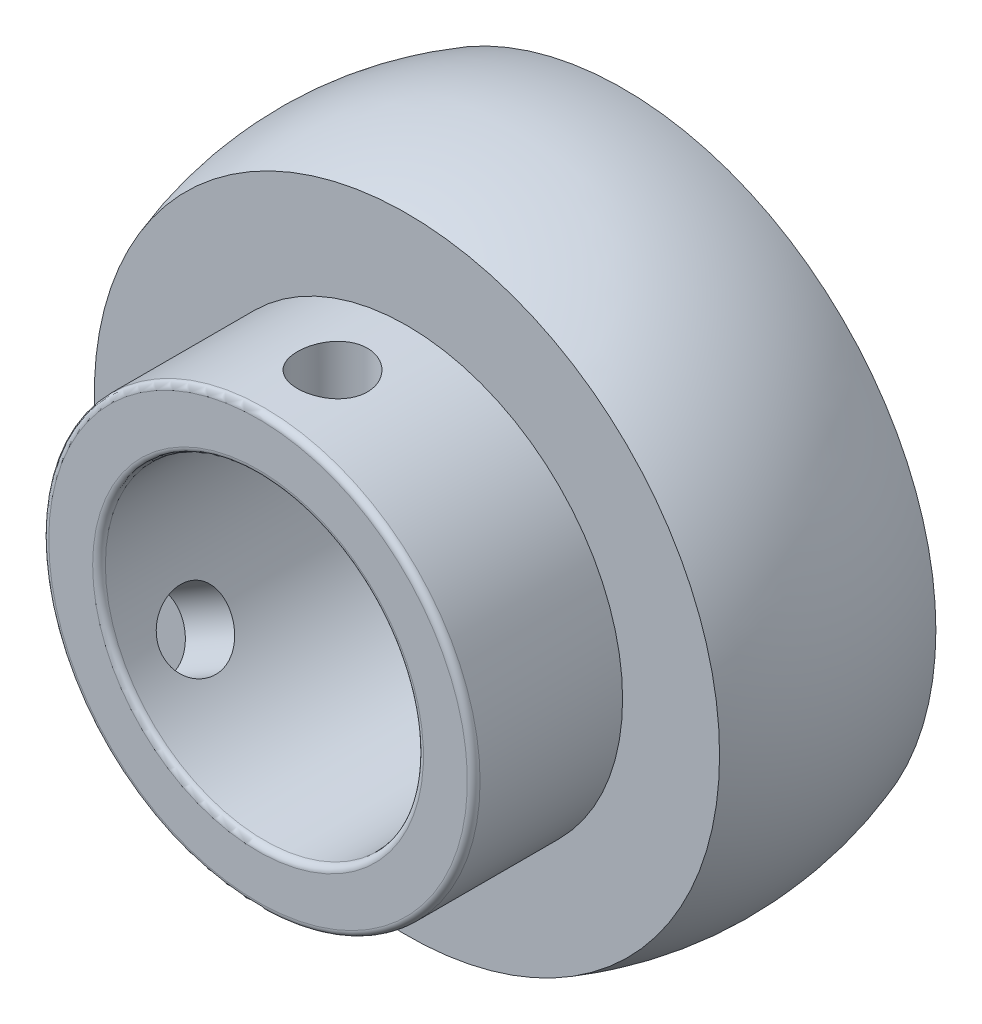
ISO-10303-21;
HEADER;
FILE_DESCRIPTION(('STEP AP214'),'2;1');
FILE_NAME('part.step','',(''),(''),'','','');
FILE_SCHEMA(('AUTOMOTIVE_DESIGN { 1 0 10303 214 1 1 1 1 }'));
ENDSEC;
DATA;
#1=APPLICATION_CONTEXT('core data for automotive mechanical design processes');
#2=APPLICATION_PROTOCOL_DEFINITION('international standard','automotive_design',2000,#1);
#3=PRODUCT_CONTEXT('',#1,'mechanical');
#4=PRODUCT('Part','Part','',(#3));
#5=PRODUCT_RELATED_PRODUCT_CATEGORY('part','',(#4));
#6=PRODUCT_DEFINITION_FORMATION('','',#4);
#7=PRODUCT_DEFINITION_CONTEXT('part definition',#1,'design');
#8=PRODUCT_DEFINITION('design','',#6,#7);
#9=PRODUCT_DEFINITION_SHAPE('','',#8);
#10=(LENGTH_UNIT() NAMED_UNIT(*) SI_UNIT(.MILLI.,.METRE.));
#11=(NAMED_UNIT(*) PLANE_ANGLE_UNIT() SI_UNIT($,.RADIAN.));
#12=(NAMED_UNIT(*) SI_UNIT($,.STERADIAN.) SOLID_ANGLE_UNIT());
#13=UNCERTAINTY_MEASURE_WITH_UNIT(LENGTH_MEASURE(1.E-05),#10,'distance_accuracy_value','');
#14=(GEOMETRIC_REPRESENTATION_CONTEXT(3) GLOBAL_UNCERTAINTY_ASSIGNED_CONTEXT((#13)) GLOBAL_UNIT_ASSIGNED_CONTEXT((#10,
#11,#12)) REPRESENTATION_CONTEXT('',''));
#15=CARTESIAN_POINT('',(0.,0.,0.));
#16=DIRECTION('',(0.,0.,1.));
#17=DIRECTION('',(1.,0.,0.));
#18=AXIS2_PLACEMENT_3D('',#15,#16,#17);
#19=CARTESIAN_POINT('',(0.,0.,1108.80906234376));
#20=DIRECTION('',(0.,0.,1.));
#21=DIRECTION('',(1.,0.,0.));
#22=AXIS2_PLACEMENT_3D('',#19,#20,#21);
#23=CYLINDRICAL_SURFACE('',#22,16.95);
#24=CARTESIAN_POINT('',(0.,0.,11.2000000000001));
#25=DIRECTION('',(0.,0.,-1.));
#26=DIRECTION('',(-1.,0.,0.));
#27=AXIS2_PLACEMENT_3D('',#24,#25,#26);
#28=CIRCLE('',#27,16.95);
#29=CARTESIAN_POINT('',(-16.95,0.,11.2000000000001));
#30=VERTEX_POINT('',#29);
#31=EDGE_CURVE('E10',#30,#30,#28,.T.);
#32=ORIENTED_EDGE('',*,*,#31,.T.);
#33=EDGE_LOOP('',(#32));
#34=FACE_BOUND('',#33,.T.);
#35=CARTESIAN_POINT('',(-15.8596470443708,-5.98114500977696,5.85000000000002));
#36=CARTESIAN_POINT('',(-15.8596462910381,-5.98115174981211,6.00337408236018));
#37=CARTESIAN_POINT('',(-15.8550566307016,-5.99336091997057,6.15683337646068));
#38=CARTESIAN_POINT('',(-15.8366724370185,-6.0417671910909,6.45945036918039));
#39=CARTESIAN_POINT('',(-15.8228692800347,-6.07798676506253,6.6086039011244));
#40=CARTESIAN_POINT('',(-15.7860310091049,-6.17303043917451,6.89818582192308));
#41=CARTESIAN_POINT('',(-15.7630034361827,-6.23183607344074,7.03862122985632));
#42=CARTESIAN_POINT('',(-15.7077009184341,-6.36994028680056,7.30700553622687));
#43=CARTESIAN_POINT('',(-15.6754270779685,-6.44923641842801,7.43495592341176));
#44=CARTESIAN_POINT('',(-15.6013771628814,-6.6263712800195,7.67595054758589));
#45=CARTESIAN_POINT('',(-15.5595238716469,-6.72435954856196,7.78886116296499));
#46=CARTESIAN_POINT('',(-15.4666933373265,-6.93521019990093,7.99541124853216));
#47=CARTESIAN_POINT('',(-15.4157155647878,-7.04807344572565,8.08904959975863));
#48=CARTESIAN_POINT('',(-15.3048270775974,-7.28574181751346,8.25489634410702));
#49=CARTESIAN_POINT('',(-15.2448675413527,-7.41061078389685,8.3269807285113));
#50=CARTESIAN_POINT('',(-15.1171449994173,-7.66779080520888,8.44687660014083));
#51=CARTESIAN_POINT('',(-15.0493824751406,-7.8001014007607,8.49468958383335));
#52=CARTESIAN_POINT('',(-14.9080735493801,-8.06687154563015,8.56427770143223));
#53=CARTESIAN_POINT('',(-14.8345829861523,-8.20130213513919,8.58627715502793));
#54=CARTESIAN_POINT('',(-14.6831687498486,-8.46940068306775,8.60431098993956));
#55=CARTESIAN_POINT('',(-14.6052453633176,-8.60306869016861,8.60034704768439));
#56=CARTESIAN_POINT('',(-14.4480145560672,-8.86456108327893,8.56674212530542));
#57=CARTESIAN_POINT('',(-14.3687269946498,-8.99242854638151,8.53734253471723));
#58=CARTESIAN_POINT('',(-14.2106294533691,-9.24024501019523,8.45408063461123));
#59=CARTESIAN_POINT('',(-14.1318194875157,-9.36019377962793,8.40021761096045));
#60=CARTESIAN_POINT('',(-13.9770982305871,-9.58970715050389,8.26931593899699));
#61=CARTESIAN_POINT('',(-13.901201081544,-9.69922417874228,8.19217723301118));
#62=CARTESIAN_POINT('',(-13.7555097448136,-9.9047638410086,8.01698711549566));
#63=CARTESIAN_POINT('',(-13.6857160263477,-10.0007854378746,7.91893409809854));
#64=CARTESIAN_POINT('',(-13.5542466384141,-10.178273910667,7.70335824516074));
#65=CARTESIAN_POINT('',(-13.4926735469916,-10.2595607252343,7.58562449146299));
#66=CARTESIAN_POINT('',(-13.3812504446696,-10.4044710524195,7.33474148521148));
#67=CARTESIAN_POINT('',(-13.3314005312238,-10.4680944182038,7.20159210452284));
#68=CARTESIAN_POINT('',(-13.245654528233,-10.5763857231716,6.92342384624294));
#69=CARTESIAN_POINT('',(-13.2097727232128,-10.6210342619512,6.77839300049092));
#70=CARTESIAN_POINT('',(-13.1537746043906,-10.6903094861815,6.48070778065528));
#71=CARTESIAN_POINT('',(-13.1336569794752,-10.7149378367257,6.32805404169438));
#72=CARTESIAN_POINT('',(-13.1103289348569,-10.7434685174464,6.02130757597654));
#73=CARTESIAN_POINT('',(-13.1069296448467,-10.7476023821559,5.86725071743524));
#74=CARTESIAN_POINT('',(-13.1166964976695,-10.7356802347487,5.5604539233994));
#75=CARTESIAN_POINT('',(-13.1298620355698,-10.7196249599212,5.40771394001886));
#76=CARTESIAN_POINT('',(-13.1719747876214,-10.6678335135248,5.1088171618045));
#77=CARTESIAN_POINT('',(-13.2008275298305,-10.6322151424471,4.96262657302503));
#78=CARTESIAN_POINT('',(-13.2728770360505,-10.5421317562364,4.67990771770392));
#79=CARTESIAN_POINT('',(-13.3160746174851,-10.487665667081,4.54338000232771));
#80=CARTESIAN_POINT('',(-13.4152910276631,-10.3604539319261,4.28254710438371));
#81=CARTESIAN_POINT('',(-13.4714188468294,-10.2875523492786,4.15835945732246));
#82=CARTESIAN_POINT('',(-13.5938425721377,-10.1252285570984,3.92694516672308));
#83=CARTESIAN_POINT('',(-13.6601391545629,-10.0358052486918,3.81971965223172));
#84=CARTESIAN_POINT('',(-13.8008740522057,-9.84138656719045,3.62420122187582));
#85=CARTESIAN_POINT('',(-13.875385960358,-9.73624683052579,3.53610466952486));
#86=CARTESIAN_POINT('',(-14.0290647798705,-9.51347080104401,3.38271829712443));
#87=CARTESIAN_POINT('',(-14.1082315467482,-9.39583489600505,3.31742776963323));
#88=CARTESIAN_POINT('',(-14.2679340600251,-9.1514890616661,3.21181463499007));
#89=CARTESIAN_POINT('',(-14.3484626346489,-9.02481944476585,3.17138800759656));
#90=CARTESIAN_POINT('',(-14.5084296374703,-8.76533986872388,3.11631480246032));
#91=CARTESIAN_POINT('',(-14.5878681499944,-8.63253038807117,3.10166621925908));
#92=CARTESIAN_POINT('',(-14.7422731200954,-8.36608179390217,3.09862022189213));
#93=CARTESIAN_POINT('',(-14.8172804267719,-8.23246967704893,3.10992357891809));
#94=CARTESIAN_POINT('',(-14.961792130735,-7.96681541877084,3.15781498955059));
#95=CARTESIAN_POINT('',(-15.0312965549764,-7.83477326965851,3.19440291929717));
#96=CARTESIAN_POINT('',(-15.163198444751,-7.57634192991746,3.29171239637208));
#97=CARTESIAN_POINT('',(-15.2256029423898,-7.44994722250901,3.35240979207613));
#98=CARTESIAN_POINT('',(-15.3423292272478,-7.20650265059764,3.49618232202034));
#99=CARTESIAN_POINT('',(-15.3966506638358,-7.08945319157965,3.57925842657642));
#100=CARTESIAN_POINT('',(-15.4971087492387,-6.86710912075234,3.76649684104858));
#101=CARTESIAN_POINT('',(-15.5431498893181,-6.76195630005735,3.87087879237434));
#102=CARTESIAN_POINT('',(-15.6259813633791,-6.56828214368505,4.09730439294206));
#103=CARTESIAN_POINT('',(-15.6627695277473,-6.47976470985691,4.21935217387131));
#104=CARTESIAN_POINT('',(-15.7271739527252,-6.32185428604761,4.47860841803772));
#105=CARTESIAN_POINT('',(-15.7547274618221,-6.25259266438729,4.61591248676573));
#106=CARTESIAN_POINT('',(-15.8002968495197,-6.13653323849323,4.90107777519187));
#107=CARTESIAN_POINT('',(-15.8183223600545,-6.08971275280831,5.0489281612112));
#108=CARTESIAN_POINT('',(-15.8409637349658,-6.03050790736157,5.3061494714925));
#109=CARTESIAN_POINT('',(-15.8479696608116,-6.01203236070585,5.41395393949813));
#110=CARTESIAN_POINT('',(-15.8573115454801,-5.98734860912903,5.6311578266936));
#111=CARTESIAN_POINT('',(-15.8596475819247,-5.98114020030604,5.74055721934247));
#112=CARTESIAN_POINT('',(-15.8596470443708,-5.98114500977696,5.85000000000002));
#113=B_SPLINE_CURVE_WITH_KNOTS('',3,(#35,#36,#37,#38,#39,#40,#41,#42,#43,#44,#45,#46,#47,#48,
#49,#50,#51,#52,#53,#54,#55,#56,#57,#58,#59,#60,#61,#62,#63,#64,#65,#66,#67,#68,#69,#70,#71,#72,
#73,#74,#75,#76,#77,#78,#79,#80,#81,#82,#83,#84,#85,#86,#87,#88,#89,#90,#91,#92,#93,#94,#95,#96,
#97,#98,#99,#100,#101,#102,#103,#104,#105,#106,#107,#108,#109,#110,#111,#112),.UNSPECIFIED.,.T.,
.F.,(4,2,2,2,2,2,2,2,2,2,2,2,2,2,2,2,2,2,2,2,2,2,2,2,2,2,2,2,2,2,2,2,2,2,2,2,2,2,4),(0.,
0.459722087063456,0.919875068730116,1.37965263736226,1.83937531370516,2.30294299209723,
2.76653757797589,3.23275024219922,3.69893415831795,4.16103620542986,4.62310841539724,
5.08084297597257,5.53859089952747,5.99833532704694,6.45811506792315,6.92318181536329,
7.38825242872168,7.8537974061869,8.31930365997489,8.77953872301793,9.23975697917785,
9.69723390846359,10.1547369110082,10.6162473052031,11.0777884059003,11.5438641519955,
12.0099254391606,12.4740234151387,12.9380852840178,13.396823376938,13.8555592226822,
14.3138366847086,14.7721340203356,15.2354189997983,15.6988125080372,16.16529388953,
16.6313027947961,16.959351048331,17.2873938490681),.UNSPECIFIED.);
#114=CARTESIAN_POINT('',(-15.8596470443708,-5.98114500977696,5.85000000000002));
#115=VERTEX_POINT('',#114);
#116=EDGE_CURVE('E75',#115,#115,#113,.T.);
#117=ORIENTED_EDGE('',*,*,#116,.T.);
#118=EDGE_LOOP('',(#117));
#119=FACE_BOUND('',#118,.T.);
#120=CARTESIAN_POINT('',(0.,0.,0.));
#121=DIRECTION('',(0.,0.,1.));
#122=DIRECTION('',(1.,0.,0.));
#123=AXIS2_PLACEMENT_3D('',#120,#121,#122);
#124=CIRCLE('',#123,16.95);
#125=CARTESIAN_POINT('',(16.95,0.,0.));
#126=VERTEX_POINT('',#125);
#127=EDGE_CURVE('E66',#126,#126,#124,.T.);
#128=ORIENTED_EDGE('',*,*,#127,.T.);
#129=EDGE_LOOP('',(#128));
#130=FACE_BOUND('',#129,.T.);
#131=CARTESIAN_POINT('',(0.,16.95,3.10000000000002));
#132=CARTESIAN_POINT('',(-0.153389059454766,16.9499974130401,3.10000620112862));
#133=CARTESIAN_POINT('',(-0.306863292480428,16.947896133266,3.11287691126683));
#134=CARTESIAN_POINT('',(-0.609511314947893,16.9397160235475,3.16400058951898));
#135=CARTESIAN_POINT('',(-0.758680949663987,16.9336334767425,3.20227727680194));
#136=CARTESIAN_POINT('',(-1.0482969489586,16.9181734303794,3.30303015296313));
#137=CARTESIAN_POINT('',(-1.18875019627735,16.9087985705178,3.36548695890764));
#138=CARTESIAN_POINT('',(-1.45716449699236,16.8877861005744,3.51277731265846));
#139=CARTESIAN_POINT('',(-1.58512706041742,16.876148764519,3.59760815101248));
#140=CARTESIAN_POINT('',(-1.82610836260845,16.8517843803313,3.78805824938138));
#141=CARTESIAN_POINT('',(-1.93899723649143,16.8390492465989,3.89384081376929));
#142=CARTESIAN_POINT('',(-2.14550523830881,16.8139868653862,4.12284009422015));
#143=CARTESIAN_POINT('',(-2.23912318048418,16.8016596430442,4.24605788230258));
#144=CARTESIAN_POINT('',(-2.4049482400678,16.7787304854001,4.50731669008348));
#145=CARTESIAN_POINT('',(-2.47702769368394,16.7681389989981,4.64543973692465));
#146=CARTESIAN_POINT('',(-2.59691346709427,16.7499922306476,4.93203320848444));
#147=CARTESIAN_POINT('',(-2.64472133851663,16.7424367546201,5.08050297107031));
#148=CARTESIAN_POINT('',(-2.7142992775722,16.7312976935851,5.38220163852072));
#149=CARTESIAN_POINT('',(-2.73629304816392,16.7276800042314,5.53537767011275));
#150=CARTESIAN_POINT('',(-2.7543118961929,16.7247228602696,5.84328551995204));
#151=CARTESIAN_POINT('',(-2.75033871547278,16.7253831187,5.99801723315021));
#152=CARTESIAN_POINT('',(-2.71671882279076,16.7308761179047,6.30305187356132));
#153=CARTESIAN_POINT('',(-2.68732281488257,16.7356681126786,6.45338327277067));
#154=CARTESIAN_POINT('',(-2.60408488113202,16.7488209028777,6.74695155476423));
#155=CARTESIAN_POINT('',(-2.55024215705012,16.7571818148354,6.89018820571977));
#156=CARTESIAN_POINT('',(-2.41938320674402,16.7765746647278,7.16625492776145));
#157=CARTESIAN_POINT('',(-2.34226230193971,16.7876186232151,7.29903450085429));
#158=CARTESIAN_POINT('',(-2.16711055242278,16.8111247531707,7.54986315720259));
#159=CARTESIAN_POINT('',(-2.06907810663207,16.8235870331977,7.667911111444));
#160=CARTESIAN_POINT('',(-1.85351728857188,16.8487049339815,7.88737727369986));
#161=CARTESIAN_POINT('',(-1.73577369132912,16.8613611077523,7.98858414253347));
#162=CARTESIAN_POINT('',(-1.48486233044964,16.8853054479757,8.16983526519684));
#163=CARTESIAN_POINT('',(-1.35169447685486,16.896593606449,8.24987939559137));
#164=CARTESIAN_POINT('',(-1.07352031607205,16.9165448634316,8.38654980154586));
#165=CARTESIAN_POINT('',(-0.928505002404181,16.9252059408055,8.44315805895717));
#166=CARTESIAN_POINT('',(-0.63085367379564,16.9389107688613,8.53115711172265));
#167=CARTESIAN_POINT('',(-0.478218263593114,16.9439548061083,8.5625499048318));
#168=CARTESIAN_POINT('',(-0.171481721980738,16.9498188541912,8.59894191478247));
#169=CARTESIAN_POINT('',(-0.0174158819668336,16.9506853126854,8.60423137250858));
#170=CARTESIAN_POINT('',(0.289401189382925,16.9482235782016,8.58903941934736));
#171=CARTESIAN_POINT('',(0.442152468359942,16.9448955378869,8.56855894638488));
#172=CARTESIAN_POINT('',(0.741112647800682,16.9344474931192,8.50264989312986));
#173=CARTESIAN_POINT('',(0.887353913818307,16.9273492404217,8.45736437597433));
#174=CARTESIAN_POINT('',(1.17016852324185,16.9101536436188,8.3432827811373));
#175=CARTESIAN_POINT('',(1.30674134711993,16.9000561385016,8.27448544121816));
#176=CARTESIAN_POINT('',(1.56760726939961,16.8778674448984,8.11466391420762));
#177=CARTESIAN_POINT('',(1.69178742620458,16.8657602025153,8.02345765140552));
#178=CARTESIAN_POINT('',(1.92318302950037,16.8409451929571,7.82165858397314));
#179=CARTESIAN_POINT('',(2.03039731119286,16.8282373846277,7.71106444935923));
#180=CARTESIAN_POINT('',(2.22588818054235,16.8035040993372,7.47232987492587));
#181=CARTESIAN_POINT('',(2.31396908382058,16.7914865207447,7.34402825036072));
#182=CARTESIAN_POINT('',(2.46732803492165,16.7696397697313,7.07427965391665));
#183=CARTESIAN_POINT('',(2.53260677754169,16.7598105306334,6.93283308273942));
#184=CARTESIAN_POINT('',(2.63821277839327,16.7435120658835,6.641366885527));
#185=CARTESIAN_POINT('',(2.67863897017396,16.7370295343326,6.49138388322083));
#186=CARTESIAN_POINT('',(2.73370467180344,16.7281245271578,6.1866428556018));
#187=CARTESIAN_POINT('',(2.74834629502106,16.7257017187895,6.03188522268786));
#188=CARTESIAN_POINT('',(2.75137067254371,16.7252042980443,5.72394094521704));
#189=CARTESIAN_POINT('',(2.74006134344572,16.727078697641,5.57075731953614));
#190=CARTESIAN_POINT('',(2.69216902032867,16.7348530057471,5.26850272269664));
#191=CARTESIAN_POINT('',(2.65558609612248,16.740752903137,5.11943174017893));
#192=CARTESIAN_POINT('',(2.55830053485422,16.7558944849549,4.82974382002459));
#193=CARTESIAN_POINT('',(2.49762304197272,16.7651326847553,4.68911824464745));
#194=CARTESIAN_POINT('',(2.3539020817855,16.7859135582853,4.41999310976271));
#195=CARTESIAN_POINT('',(2.27085760097402,16.7974563364353,4.29149410009738));
#196=CARTESIAN_POINT('',(2.08365557459899,16.8217080725818,4.04871156930423));
#197=CARTESIAN_POINT('',(1.97927106152911,16.834428687139,3.93460419632951));
#198=CARTESIAN_POINT('',(1.75283116153535,16.8595086456252,3.72541894768741));
#199=CARTESIAN_POINT('',(1.63077169536769,16.8718679053628,3.63034547700014));
#200=CARTESIAN_POINT('',(1.3715044049896,16.8949255274868,3.46136424326375));
#201=CARTESIAN_POINT('',(1.2342031227464,16.9056125516139,3.38759832316801));
#202=CARTESIAN_POINT('',(0.949043374706975,16.9240110777408,3.26428967272681));
#203=CARTESIAN_POINT('',(0.801195712296509,16.9317255742712,3.21472255094327));
#204=CARTESIAN_POINT('',(0.543956994970018,16.9416049080306,3.15211170202708));
#205=CARTESIAN_POINT('',(0.436131215104201,16.9447364230155,3.1326007125166));
#206=CARTESIAN_POINT('',(0.218884732317048,16.9489348757536,3.10654275131267));
#207=CARTESIAN_POINT('',(0.109464054640321,16.9500018461494,3.09999557464738));
#208=CARTESIAN_POINT('',(0.,16.95,3.10000000000002));
#209=B_SPLINE_CURVE_WITH_KNOTS('',3,(#131,#132,#133,#134,#135,#136,#137,#138,#139,#140,#141,
#142,#143,#144,#145,#146,#147,#148,#149,#150,#151,#152,#153,#154,#155,#156,#157,#158,#159,#160,
#161,#162,#163,#164,#165,#166,#167,#168,#169,#170,#171,#172,#173,#174,#175,#176,#177,#178,#179,
#180,#181,#182,#183,#184,#185,#186,#187,#188,#189,#190,#191,#192,#193,#194,#195,#196,#197,#198,
#199,#200,#201,#202,#203,#204,#205,#206,#207,#208),.UNSPECIFIED.,.T.,.F.,(4,2,2,2,2,2,2,2,2,2,2,
2,2,2,2,2,2,2,2,2,2,2,2,2,2,2,2,2,2,2,2,2,2,2,2,2,2,2,4),(0.,0.459767091588934,
0.919964029322791,1.37979283159832,1.83956597503691,2.3030747422894,2.76661202116426,
3.2328446503992,3.69904747066662,4.16117966499257,4.62328086017345,5.08087639959464,
5.53848688160015,5.99818662950461,6.45792158665255,6.92304993862742,7.38818100348203,
7.85366901285281,8.31912013919287,8.77938410605079,9.23963132158241,9.69725159111427,
10.1548964319564,10.6163903663298,11.0779159710033,11.5439600977784,12.0099900226359,
12.4741525451739,12.9382770219998,13.3969230274058,13.8555677659056,14.3137351326608,
14.7719232636514,15.2352649598518,15.6987137627061,16.1651801338753,16.6311753494978,
16.9592871846755,17.2873938320101),.UNSPECIFIED.);
#210=CARTESIAN_POINT('',(0.,16.95,3.10000000000002));
#211=VERTEX_POINT('',#210);
#212=EDGE_CURVE('E100',#211,#211,#209,.T.);
#213=ORIENTED_EDGE('',*,*,#212,.F.);
#214=EDGE_LOOP('',(#213));
#215=FACE_BOUND('',#214,.T.);
#216=ADVANCED_FACE('F34',(#34,#119,#130,#215),#23,.T.);
#217=CARTESIAN_POINT('',(0.,0.,1108.80906234376));
#218=DIRECTION('',(0.,0.,1.));
#219=DIRECTION('',(1.,0.,0.));
#220=AXIS2_PLACEMENT_3D('',#217,#218,#219);
#221=CYLINDRICAL_SURFACE('',#220,12.5);
#222=CARTESIAN_POINT('',(0.,0.,-22.));
#223=DIRECTION('',(0.,0.,1.));
#224=DIRECTION('',(1.,0.,0.));
#225=AXIS2_PLACEMENT_3D('',#222,#223,#224);
#226=CIRCLE('',#225,12.5);
#227=CARTESIAN_POINT('',(12.5,0.,-22.));
#228=VERTEX_POINT('',#227);
#229=EDGE_CURVE('E54',#228,#228,#226,.F.);
#230=ORIENTED_EDGE('',*,*,#229,.T.);
#231=EDGE_LOOP('',(#230));
#232=FACE_BOUND('',#231,.T.);
#233=CARTESIAN_POINT('',(0.,0.,11.2000000000001));
#234=DIRECTION('',(0.,0.,-1.));
#235=DIRECTION('',(-1.,0.,0.));
#236=AXIS2_PLACEMENT_3D('',#233,#234,#235);
#237=CIRCLE('',#236,12.5);
#238=CARTESIAN_POINT('',(-12.5,0.,11.2000000000001));
#239=VERTEX_POINT('',#238);
#240=EDGE_CURVE('E57',#239,#239,#237,.F.);
#241=ORIENTED_EDGE('',*,*,#240,.T.);
#242=EDGE_LOOP('',(#241));
#243=FACE_BOUND('',#242,.T.);
#244=CARTESIAN_POINT('',(-11.9350958802466,-3.71530433872136,5.85000000000002));
#245=CARTESIAN_POINT('',(-11.9350959421544,-3.71531039355691,5.69755044855787));
#246=CARTESIAN_POINT('',(-11.9312387953617,-3.72776518671708,5.54503844519472));
#247=CARTESIAN_POINT('',(-11.9157176990372,-3.77707764434757,5.2443532257192));
#248=CARTESIAN_POINT('',(-11.9040481478612,-3.81395281849605,5.09618320251471));
#249=CARTESIAN_POINT('',(-11.8726705054209,-3.91053099109244,4.80857495152139));
#250=CARTESIAN_POINT('',(-11.8529712920794,-3.97020877349702,4.66912727572907));
#251=CARTESIAN_POINT('',(-11.8051932702877,-4.11009131648416,4.40253075517857));
#252=CARTESIAN_POINT('',(-11.7771146138174,-4.19029570476707,4.27538168741301));
#253=CARTESIAN_POINT('',(-11.7117229891937,-4.36975741563501,4.03481709873047));
#254=CARTESIAN_POINT('',(-11.6742748880811,-4.46928830723811,3.92164235165356));
#255=CARTESIAN_POINT('',(-11.5901209334891,-4.68319152404556,3.71434820610846));
#256=CARTESIAN_POINT('',(-11.5434143557306,-4.79756501012604,3.62023029959873));
#257=CARTESIAN_POINT('',(-11.4402261393373,-5.03870821417515,3.45276783915348));
#258=CARTESIAN_POINT('',(-11.3836457488931,-5.16559691707981,3.37965505380457));
#259=CARTESIAN_POINT('',(-11.2615705708165,-5.42657839517375,3.25777799287573));
#260=CARTESIAN_POINT('',(-11.1960767964547,-5.56067035045239,3.20901095261685));
#261=CARTESIAN_POINT('',(-11.0584111551619,-5.82957864179667,3.13796750093569));
#262=CARTESIAN_POINT('',(-10.9863615633898,-5.96434982435288,3.11528353884846));
#263=CARTESIAN_POINT('',(-10.8364739347006,-6.23252890859241,3.09577572289064));
#264=CARTESIAN_POINT('',(-10.7586365684359,-6.36593696619512,3.09894887746648));
#265=CARTESIAN_POINT('',(-10.6008945600583,-6.62523066238181,3.13076208382542));
#266=CARTESIAN_POINT('',(-10.521048566018,-6.75120625836825,3.1589628239089));
#267=CARTESIAN_POINT('',(-10.3606933360806,-6.99480607750879,3.23933039693701));
#268=CARTESIAN_POINT('',(-10.2801840701301,-7.11242991989165,3.29149832177908));
#269=CARTESIAN_POINT('',(-10.1208394716461,-7.33742266645735,3.41870671357951));
#270=CARTESIAN_POINT('',(-10.0420208999451,-7.4447093894112,3.49391331088195));
#271=CARTESIAN_POINT('',(-9.88975525906922,-7.64582735248831,3.66494024820262));
#272=CARTESIAN_POINT('',(-9.81630893148361,-7.73965673665998,3.76076342698291));
#273=CARTESIAN_POINT('',(-9.67638566542027,-7.91393274541693,3.97269380079936));
#274=CARTESIAN_POINT('',(-9.61008794887561,-7.99405613504366,4.08918546973057));
#275=CARTESIAN_POINT('',(-9.48936405873578,-8.13699879081372,4.33789042812746));
#276=CARTESIAN_POINT('',(-9.43493821458692,-8.1998175767643,4.47010415372538));
#277=CARTESIAN_POINT('',(-9.34056000324727,-8.30717084847696,4.74710247477499));
#278=CARTESIAN_POINT('',(-9.30065193379368,-8.3516494274116,4.89192390113675));
#279=CARTESIAN_POINT('',(-9.23774553006013,-8.42118037342071,5.18967284091224));
#280=CARTESIAN_POINT('',(-9.21474447871582,-8.44623586194356,5.34259904759986));
#281=CARTESIAN_POINT('',(-9.18727557633316,-8.47610611238505,5.64883794535671));
#282=CARTESIAN_POINT('',(-9.18243535752274,-8.48132757709539,5.80207764799441));
#283=CARTESIAN_POINT('',(-9.19053413529586,-8.47255080230262,6.10752480034257));
#284=CARTESIAN_POINT('',(-9.20347189508437,-8.4585538998009,6.25973232112055));
#285=CARTESIAN_POINT('',(-9.24612121310794,-8.41190888949975,6.55691507354202));
#286=CARTESIAN_POINT('',(-9.27562959731931,-8.37948663995235,6.70195518009433));
#287=CARTESIAN_POINT('',(-9.34969008856779,-8.29676793425163,6.98279996634596));
#288=CARTESIAN_POINT('',(-9.39424364934252,-8.24646975081463,7.11860375206334));
#289=CARTESIAN_POINT('',(-9.49696730195543,-8.12796610353919,7.37944899019523));
#290=CARTESIAN_POINT('',(-9.55533847096776,-8.05949419235298,7.50429011182209));
#291=CARTESIAN_POINT('',(-9.68253981798195,-7.90622029029055,7.73754951985321));
#292=CARTESIAN_POINT('',(-9.75137131058712,-7.82141624651169,7.84596573862982));
#293=CARTESIAN_POINT('',(-9.89784262243694,-7.63524560813449,8.04539107533042));
#294=CARTESIAN_POINT('',(-9.97562420304666,-7.53359655114884,8.13603291751935));
#295=CARTESIAN_POINT('',(-10.1355815219704,-7.31697260611782,8.29470850195227));
#296=CARTESIAN_POINT('',(-10.2177570535934,-7.20199834459228,8.36274330654494));
#297=CARTESIAN_POINT('',(-10.382663060925,-6.96213566538244,8.47376381567955));
#298=CARTESIAN_POINT('',(-10.4653864727263,-6.83731644088586,8.51690923932153));
#299=CARTESIAN_POINT('',(-10.6288389993696,-6.5803454918423,8.57742440554623));
#300=CARTESIAN_POINT('',(-10.7095684059753,-6.44819484932723,8.59479794131607));
#301=CARTESIAN_POINT('',(-10.8646978398112,-6.18315686869886,8.60310394958762));
#302=CARTESIAN_POINT('',(-10.9391952394328,-6.05034340188367,8.59458452246031));
#303=CARTESIAN_POINT('',(-11.0817038753353,-5.78519639053528,8.55257355312719));
#304=CARTESIAN_POINT('',(-11.1497152308405,-5.6528628372235,8.51908247004192));
#305=CARTESIAN_POINT('',(-11.2776429320665,-5.39311407428094,8.4283428256799));
#306=CARTESIAN_POINT('',(-11.3375851885804,-5.26568410808438,8.37117283408202));
#307=CARTESIAN_POINT('',(-11.4488632847901,-5.01914773210253,8.23477450821411));
#308=CARTESIAN_POINT('',(-11.5001982777995,-4.90004214184755,8.15554400591486));
#309=CARTESIAN_POINT('',(-11.5948813886808,-4.67165057489232,7.97549095572639));
#310=CARTESIAN_POINT('',(-11.6380574627024,-4.56259671192422,7.87428347342374));
#311=CARTESIAN_POINT('',(-11.7152751022913,-4.36051138575182,7.65392471605467));
#312=CARTESIAN_POINT('',(-11.7493144601103,-4.26748379699424,7.53476911493783));
#313=CARTESIAN_POINT('',(-11.8089588139474,-4.09958034726586,7.27995294642799));
#314=CARTESIAN_POINT('',(-11.834443159762,-4.02496777614265,7.14409045102283));
#315=CARTESIAN_POINT('',(-11.8767096604059,-3.89849307605156,6.86098646177123));
#316=CARTESIAN_POINT('',(-11.8934991434493,-3.84661179437002,6.71375467088284));
#317=CARTESIAN_POINT('',(-11.9158213555797,-3.77679699829822,6.44698933092323));
#318=CARTESIAN_POINT('',(-11.9230570162631,-3.75379419259771,6.32889699113183));
#319=CARTESIAN_POINT('',(-11.9326941336216,-3.72304585441867,6.09054932377732));
#320=CARTESIAN_POINT('',(-11.9350958313966,-3.71529956100302,5.97029410439238));
#321=CARTESIAN_POINT('',(-11.9350958802466,-3.71530433872136,5.85000000000002));
#322=B_SPLINE_CURVE_WITH_KNOTS('',3,(#244,#245,#246,#247,#248,#249,#250,#251,#252,#253,#254,
#255,#256,#257,#258,#259,#260,#261,#262,#263,#264,#265,#266,#267,#268,#269,#270,#271,#272,#273,
#274,#275,#276,#277,#278,#279,#280,#281,#282,#283,#284,#285,#286,#287,#288,#289,#290,#291,#292,
#293,#294,#295,#296,#297,#298,#299,#300,#301,#302,#303,#304,#305,#306,#307,#308,#309,#310,#311,
#312,#313,#314,#315,#316,#317,#318,#319,#320,#321),.UNSPECIFIED.,.T.,.F.,(4,2,2,2,2,2,2,2,2,2,2,
2,2,2,2,2,2,2,2,2,2,2,2,2,2,2,2,2,2,2,2,2,2,2,2,2,2,2,4),(0.,0.456907752769455,
0.914143468570757,1.3708750112414,1.82759827056776,2.29133235401602,2.75510272914129,
3.22380935312457,3.69246273912882,4.15368936721782,4.61486263419186,5.06809754843004,
5.52135311320052,5.97795723699876,6.43462427233989,6.90090287975453,7.36719442482738,
7.83489705115352,8.30252449827769,8.76050965705077,9.21846295589718,9.67092013416634,
10.1234210435483,10.5829625331187,11.0425618234929,11.5108380114301,11.9790921910453,
12.4443070895855,12.9094535095449,13.3648228131603,13.8201837447139,14.274045682984,
14.7279522409586,15.190563398098,15.6532862377558,16.1222846532882,16.5908871410879,
16.9514395333876,17.3119739422421),.UNSPECIFIED.);
#323=CARTESIAN_POINT('',(-11.9350958802466,-3.71530433872136,5.85000000000002));
#324=VERTEX_POINT('',#323);
#325=EDGE_CURVE('E67',#324,#324,#322,.T.);
#326=ORIENTED_EDGE('',*,*,#325,.T.);
#327=EDGE_LOOP('',(#326));
#328=FACE_BOUND('',#327,.T.);
#329=CARTESIAN_POINT('',(0.,12.5,3.10000000000002));
#330=CARTESIAN_POINT('',(0.152499898901336,12.4999971904018,3.1000051768612));
#331=CARTESIAN_POINT('',(0.305062161426222,12.4971809160244,3.11272803155225));
#332=CARTESIAN_POINT('',(0.605851705533584,12.4862182922224,3.16322956765222));
#333=CARTESIAN_POINT('',(0.754075836191731,12.4780681643328,3.20102601127741));
#334=CARTESIAN_POINT('',(1.04179873794701,12.4573450970559,3.30043241005134));
#335=CARTESIAN_POINT('',(1.18130649806288,12.444776805756,3.36201734544285));
#336=CARTESIAN_POINT('',(1.44800450052414,12.4165731912253,3.50717281847305));
#337=CARTESIAN_POINT('',(1.57519503267054,12.4009379401806,3.59074283867238));
#338=CARTESIAN_POINT('',(1.81571618223769,12.3680290304409,3.77893085135143));
#339=CARTESIAN_POINT('',(1.92881838234886,12.3507348544623,3.88383721854921));
#340=CARTESIAN_POINT('',(2.13597154753236,12.3166015003304,4.11110099702078));
#341=CARTESIAN_POINT('',(2.23002079808758,12.2997623632427,4.23345997711545));
#342=CARTESIAN_POINT('',(2.39740867979453,12.2682432110521,4.49384776178367));
#343=CARTESIAN_POINT('',(2.47050367145455,12.2535894774134,4.63203665338985));
#344=CARTESIAN_POINT('',(2.59234515900315,12.2283949550516,4.91911209029151));
#345=CARTESIAN_POINT('',(2.64109460275622,12.2178536684094,5.06799733792742));
#346=CARTESIAN_POINT('',(2.71210534602432,12.2022865896352,5.36976006767229));
#347=CARTESIAN_POINT('',(2.73477130892755,12.1971766330976,5.52253788949545));
#348=CARTESIAN_POINT('',(2.75423002278169,12.1927980383752,5.82980655974724));
#349=CARTESIAN_POINT('',(2.75102599243802,12.1935286735126,5.98429719268207));
#350=CARTESIAN_POINT('',(2.71916121336884,12.2006725337386,6.28759419721574));
#351=CARTESIAN_POINT('',(2.69097101072003,12.2069807156787,6.43645285456913));
#352=CARTESIAN_POINT('',(2.61067978779718,12.2244027664908,6.72727485612079));
#353=CARTESIAN_POINT('',(2.5585774119886,12.2355169078011,6.8692378089104));
#354=CARTESIAN_POINT('',(2.43150997814891,12.2614018322269,7.14355905858779));
#355=CARTESIAN_POINT('',(2.35636438040497,12.2762013107913,7.27583090781829));
#356=CARTESIAN_POINT('',(2.18547052826984,12.307771835686,7.52606136371008));
#357=CARTESIAN_POINT('',(2.0897194344459,12.3245431535907,7.64401799423041));
#358=CARTESIAN_POINT('',(1.87784383133749,12.3586180294322,7.86497827148902));
#359=CARTESIAN_POINT('',(1.76131931388323,12.3759252028118,7.96759818110825));
#360=CARTESIAN_POINT('',(1.51251817509827,12.4087875875483,8.15190270652012));
#361=CARTESIAN_POINT('',(1.38024126199674,12.4243427664439,8.23358693444711));
#362=CARTESIAN_POINT('',(1.10321877982549,12.4519999351098,8.37379794077393));
#363=CARTESIAN_POINT('',(0.958446722755981,12.4640943422584,8.43227397632417));
#364=CARTESIAN_POINT('',(0.660806068098085,12.4834109520886,8.52396235795305));
#365=CARTESIAN_POINT('',(0.507938665483062,12.4906338717121,8.55717842165947));
#366=CARTESIAN_POINT('',(0.201737834472081,12.4992914762452,8.59684477042221));
#367=CARTESIAN_POINT('',(0.048475416889955,12.5008394898157,8.60381918060438));
#368=CARTESIAN_POINT('',(-0.25702463922313,12.4982906394976,8.5922255082855));
#369=CARTESIAN_POINT('',(-0.409262347393955,12.4941941631848,8.57365917952571));
#370=CARTESIAN_POINT('',(-0.706651679581553,12.4808881835271,8.51194558112977));
#371=CARTESIAN_POINT('',(-0.85186323050571,12.4717359796514,8.46907364028685));
#372=CARTESIAN_POINT('',(-1.13303374349272,12.4493431304029,8.36027173739438));
#373=CARTESIAN_POINT('',(-1.2689919097809,12.4361021339418,8.2943397952112));
#374=CARTESIAN_POINT('',(-1.52996043630242,12.4067211728582,8.14020036130251));
#375=CARTESIAN_POINT('',(-1.65478476584192,12.3905421765699,8.05168551287353));
#376=CARTESIAN_POINT('',(-1.88799618680304,12.3571587900568,7.85529714968916));
#377=CARTESIAN_POINT('',(-1.99638111329764,12.3399542651937,7.74742108930682));
#378=CARTESIAN_POINT('',(-2.19571266647718,12.3060667952223,7.51296620233374));
#379=CARTESIAN_POINT('',(-2.28629616081597,12.289399573035,7.38607594784087));
#380=CARTESIAN_POINT('',(-2.44486941307565,12.2588401261521,7.11857595796972));
#381=CARTESIAN_POINT('',(-2.51286015224752,12.2449477809481,6.97796681877476));
#382=CARTESIAN_POINT('',(-2.62385616256412,12.2216446535348,6.6877763844952));
#383=CARTESIAN_POINT('',(-2.66700249710152,12.2122086250619,6.5382511728736));
#384=CARTESIAN_POINT('',(-2.72749692587736,12.198841660728,6.23383836548849));
#385=CARTESIAN_POINT('',(-2.74484920100898,12.1949098327112,6.07895164292418));
#386=CARTESIAN_POINT('',(-2.753083398086,12.1930531276204,5.77187505119136));
#387=CARTESIAN_POINT('',(-2.74454124236211,12.194997552861,5.61970113342946));
#388=CARTESIAN_POINT('',(-2.70251774952353,12.2043784310615,5.31901814374187));
#389=CARTESIAN_POINT('',(-2.66903671342438,12.2118148177326,5.1705090276039));
#390=CARTESIAN_POINT('',(-2.57836557196677,12.2312776508555,4.88183521059244));
#391=CARTESIAN_POINT('',(-2.52126021409683,12.2432876781769,4.74164271043278));
#392=CARTESIAN_POINT('',(-2.385033898316,12.2705508238431,4.47274306289867));
#393=CARTESIAN_POINT('',(-2.30591061596352,12.2858042845583,4.34403713006172));
#394=CARTESIAN_POINT('',(-2.12598827434472,12.3182253590237,4.09892715190097));
#395=CARTESIAN_POINT('',(-2.02477917994945,12.3354257280244,3.98282836724582));
#396=CARTESIAN_POINT('',(-1.80438792017965,12.3695834666299,3.76907344242869));
#397=CARTESIAN_POINT('',(-1.68520160275065,12.3865407791044,3.67142157456889));
#398=CARTESIAN_POINT('',(-1.43034911440665,12.4185664787701,3.49610141389577));
#399=CARTESIAN_POINT('',(-1.29448673828551,12.4336070758971,3.41871296897254));
#400=CARTESIAN_POINT('',(-1.0113796491138,12.459825398128,3.28799350279779));
#401=CARTESIAN_POINT('',(-0.864144550329219,12.4710063432971,3.23464241604464));
#402=CARTESIAN_POINT('',(-0.597314094339423,12.4862635252458,3.16296038514846));
#403=CARTESIAN_POINT('',(-0.479156348973878,12.4913826668813,3.13939551033198));
#404=CARTESIAN_POINT('',(-0.240678618977761,12.4982519366761,3.10791362927173));
#405=CARTESIAN_POINT('',(-0.120358732539654,12.500002217442,3.09999591422387));
#406=CARTESIAN_POINT('',(0.,12.5,3.10000000000002));
#407=B_SPLINE_CURVE_WITH_KNOTS('',3,(#329,#330,#331,#332,#333,#334,#335,#336,#337,#338,#339,
#340,#341,#342,#343,#344,#345,#346,#347,#348,#349,#350,#351,#352,#353,#354,#355,#356,#357,#358,
#359,#360,#361,#362,#363,#364,#365,#366,#367,#368,#369,#370,#371,#372,#373,#374,#375,#376,#377,
#378,#379,#380,#381,#382,#383,#384,#385,#386,#387,#388,#389,#390,#391,#392,#393,#394,#395,#396,
#397,#398,#399,#400,#401,#402,#403,#404,#405,#406),.UNSPECIFIED.,.T.,.F.,(4,2,2,2,2,2,2,2,2,2,2,
2,2,2,2,2,2,2,2,2,2,2,2,2,2,2,2,2,2,2,2,2,2,2,2,2,2,2,4),(0.,0.457059116247516,0.91444236098754,
1.37134585296434,1.82823859225563,2.29177467155746,2.75535244455389,3.22411991181092,
3.69283060490026,4.15416721854995,4.61544643428077,5.06821903519806,5.52101730608372,
5.97745796088984,6.43396155343811,6.90045562181949,7.36695833209504,7.83447546711244,
8.30192378213105,8.75998460972911,9.21801398639395,9.67095570384639,10.1239363243936,
10.5834456557251,11.0430154480141,11.5111606953385,11.9792856074697,12.444725669205,
12.9100902807205,13.3651811510975,13.8202665285574,14.2737333437072,14.7272480497139,
15.1900335664873,15.6529261332386,16.1219093839889,16.5905004161375,16.9512452327006,
17.3119737074312),.UNSPECIFIED.);
#408=CARTESIAN_POINT('',(0.,12.5,3.10000000000002));
#409=VERTEX_POINT('',#408);
#410=EDGE_CURVE('E76',#409,#409,#407,.T.);
#411=ORIENTED_EDGE('',*,*,#410,.F.);
#412=EDGE_LOOP('',(#411));
#413=FACE_BOUND('',#412,.T.);
#414=ADVANCED_FACE('F82',(#232,#243,#328,#413),#221,.F.);
#415=CARTESIAN_POINT('',(0.,16.95,11.7));
#416=DIRECTION('',(0.,0.,-1.));
#417=DIRECTION('',(-1.,0.,0.));
#418=AXIS2_PLACEMENT_3D('',#415,#416,#417);
#419=PLANE('',#418);
#420=CARTESIAN_POINT('',(0.,0.,11.7));
#421=DIRECTION('',(0.,0.,-1.));
#422=DIRECTION('',(-1.,0.,0.));
#423=AXIS2_PLACEMENT_3D('',#420,#421,#422);
#424=CIRCLE('',#423,13.);
#425=CARTESIAN_POINT('',(-13.,0.,11.7));
#426=VERTEX_POINT('',#425);
#427=EDGE_CURVE('E41',#426,#426,#424,.T.);
#428=ORIENTED_EDGE('',*,*,#427,.T.);
#429=EDGE_LOOP('',(#428));
#430=FACE_BOUND('',#429,.T.);
#431=CARTESIAN_POINT('',(0.,0.,11.7));
#432=DIRECTION('',(0.,0.,-1.));
#433=DIRECTION('',(-1.,0.,0.));
#434=AXIS2_PLACEMENT_3D('',#431,#432,#433);
#435=CIRCLE('',#434,16.45);
#436=CARTESIAN_POINT('',(-16.45,0.,11.7));
#437=VERTEX_POINT('',#436);
#438=EDGE_CURVE('E45',#437,#437,#435,.F.);
#439=ORIENTED_EDGE('',*,*,#438,.T.);
#440=EDGE_LOOP('',(#439));
#441=FACE_BOUND('',#440,.T.);
#442=ADVANCED_FACE('F111',(#430,#441),#419,.F.);
#443=CARTESIAN_POINT('',(0.,16.95,0.));
#444=DIRECTION('',(0.,0.,-1.));
#445=DIRECTION('',(-1.,0.,0.));
#446=AXIS2_PLACEMENT_3D('',#443,#444,#445);
#447=PLANE('',#446);
#448=ORIENTED_EDGE('',*,*,#127,.F.);
#449=EDGE_LOOP('',(#448));
#450=FACE_BOUND('',#449,.T.);
#451=CARTESIAN_POINT('',(0.,0.,0.));
#452=DIRECTION('',(0.,0.,1.));
#453=DIRECTION('',(1.,0.,0.));
#454=AXIS2_PLACEMENT_3D('',#451,#452,#453);
#455=CIRCLE('',#454,24.5713247506112);
#456=CARTESIAN_POINT('',(24.5713247506112,0.,0.));
#457=VERTEX_POINT('',#456);
#458=EDGE_CURVE('E148',#457,#457,#455,.T.);
#459=ORIENTED_EDGE('',*,*,#458,.T.);
#460=EDGE_LOOP('',(#459));
#461=FACE_BOUND('',#460,.T.);
#462=ADVANCED_FACE('F109',(#450,#461),#447,.F.);
#463=CARTESIAN_POINT('',(0.,0.,-8.5));
#464=DIRECTION('',(0.,0.,1.));
#465=DIRECTION('',(0.,1.,0.));
#466=AXIS2_PLACEMENT_3D('',#463,#464,#465);
#467=SPHERICAL_SURFACE('',#466,26.);
#468=ORIENTED_EDGE('',*,*,#458,.F.);
#469=EDGE_LOOP('',(#468));
#470=FACE_BOUND('',#469,.T.);
#471=CARTESIAN_POINT('',(0.,0.,-16.9999999999999));
#472=DIRECTION('',(0.,0.,1.));
#473=DIRECTION('',(1.,0.,0.));
#474=AXIS2_PLACEMENT_3D('',#471,#472,#473);
#475=CIRCLE('',#474,24.5713247506112);
#476=CARTESIAN_POINT('',(24.5713247506112,0.,-16.9999999999999));
#477=VERTEX_POINT('',#476);
#478=EDGE_CURVE('E144',#477,#477,#475,.T.);
#479=ORIENTED_EDGE('',*,*,#478,.T.);
#480=EDGE_LOOP('',(#479));
#481=FACE_BOUND('',#480,.T.);
#482=ADVANCED_FACE('F159',(#470,#481),#467,.T.);
#483=CARTESIAN_POINT('',(0.,16.95,-17.));
#484=DIRECTION('',(0.,0.,1.));
#485=DIRECTION('',(1.,0.,0.));
#486=AXIS2_PLACEMENT_3D('',#483,#484,#485);
#487=PLANE('',#486);
#488=ORIENTED_EDGE('',*,*,#478,.F.);
#489=EDGE_LOOP('',(#488));
#490=FACE_BOUND('',#489,.T.);
#491=CARTESIAN_POINT('',(0.,0.,-16.9999999999999));
#492=DIRECTION('',(0.,0.,1.));
#493=DIRECTION('',(1.,0.,0.));
#494=AXIS2_PLACEMENT_3D('',#491,#492,#493);
#495=CIRCLE('',#494,16.95);
#496=CARTESIAN_POINT('',(16.95,0.,-16.9999999999999));
#497=VERTEX_POINT('',#496);
#498=EDGE_CURVE('E140',#497,#497,#495,.T.);
#499=ORIENTED_EDGE('',*,*,#498,.T.);
#500=EDGE_LOOP('',(#499));
#501=FACE_BOUND('',#500,.T.);
#502=ADVANCED_FACE('F164',(#490,#501),#487,.F.);
#503=CARTESIAN_POINT('',(0.,0.,1108.80906234376));
#504=DIRECTION('',(0.,0.,1.));
#505=DIRECTION('',(1.,0.,0.));
#506=AXIS2_PLACEMENT_3D('',#503,#504,#505);
#507=CYLINDRICAL_SURFACE('',#506,16.95);
#508=CARTESIAN_POINT('',(0.,0.,-22.));
#509=DIRECTION('',(0.,0.,1.));
#510=DIRECTION('',(1.,0.,0.));
#511=AXIS2_PLACEMENT_3D('',#508,#509,#510);
#512=CIRCLE('',#511,16.95);
#513=CARTESIAN_POINT('',(16.95,0.,-22.));
#514=VERTEX_POINT('',#513);
#515=EDGE_CURVE('E49',#514,#514,#512,.T.);
#516=ORIENTED_EDGE('',*,*,#515,.T.);
#517=EDGE_LOOP('',(#516));
#518=FACE_BOUND('',#517,.T.);
#519=ORIENTED_EDGE('',*,*,#498,.F.);
#520=EDGE_LOOP('',(#519));
#521=FACE_BOUND('',#520,.T.);
#522=ADVANCED_FACE('F168',(#518,#521),#507,.T.);
#523=CARTESIAN_POINT('',(0.,16.95,-22.5));
#524=DIRECTION('',(0.,0.,1.));
#525=DIRECTION('',(1.,0.,0.));
#526=AXIS2_PLACEMENT_3D('',#523,#524,#525);
#527=PLANE('',#526);
#528=CARTESIAN_POINT('',(0.,0.,-22.5));
#529=DIRECTION('',(0.,0.,1.));
#530=DIRECTION('',(1.,0.,0.));
#531=AXIS2_PLACEMENT_3D('',#528,#529,#530);
#532=CIRCLE('',#531,13.);
#533=CARTESIAN_POINT('',(13.,0.,-22.5));
#534=VERTEX_POINT('',#533);
#535=EDGE_CURVE('E60',#534,#534,#532,.T.);
#536=ORIENTED_EDGE('',*,*,#535,.T.);
#537=EDGE_LOOP('',(#536));
#538=FACE_BOUND('',#537,.T.);
#539=CARTESIAN_POINT('',(0.,0.,-22.5));
#540=DIRECTION('',(0.,0.,1.));
#541=DIRECTION('',(1.,0.,0.));
#542=AXIS2_PLACEMENT_3D('',#539,#540,#541);
#543=CIRCLE('',#542,16.45);
#544=CARTESIAN_POINT('',(16.45,0.,-22.5));
#545=VERTEX_POINT('',#544);
#546=EDGE_CURVE('E63',#545,#545,#543,.F.);
#547=ORIENTED_EDGE('',*,*,#546,.T.);
#548=EDGE_LOOP('',(#547));
#549=FACE_BOUND('',#548,.T.);
#550=ADVANCED_FACE('F173',(#538,#549),#527,.F.);
#551=CARTESIAN_POINT('',(0.,26.,5.85000000000002));
#552=DIRECTION('',(0.,-1.,0.));
#553=DIRECTION('',(0.,0.,-1.));
#554=AXIS2_PLACEMENT_3D('',#551,#552,#553);
#555=CYLINDRICAL_SURFACE('',#554,2.75);
#556=ORIENTED_EDGE('',*,*,#410,.T.);
#557=EDGE_LOOP('',(#556));
#558=FACE_BOUND('',#557,.T.);
#559=ORIENTED_EDGE('',*,*,#212,.T.);
#560=EDGE_LOOP('',(#559));
#561=FACE_BOUND('',#560,.T.);
#562=ADVANCED_FACE('F89',(#558,#561),#555,.F.);
#563=CARTESIAN_POINT('',(-30.7583302491977,-17.7583302491976,5.85000000000002));
#564=DIRECTION('',(0.86602540378444,0.499999999999998,0.));
#565=DIRECTION('',(-0.499999999999998,0.86602540378444,0.));
#566=AXIS2_PLACEMENT_3D('',#563,#564,#565);
#567=CYLINDRICAL_SURFACE('',#566,2.75);
#568=ORIENTED_EDGE('',*,*,#325,.F.);
#569=EDGE_LOOP('',(#568));
#570=FACE_BOUND('',#569,.T.);
#571=ORIENTED_EDGE('',*,*,#116,.F.);
#572=EDGE_LOOP('',(#571));
#573=FACE_BOUND('',#572,.T.);
#574=ADVANCED_FACE('F85',(#570,#573),#567,.F.);
#575=CARTESIAN_POINT('',(0.,0.,-22.));
#576=DIRECTION('',(0.,0.,1.));
#577=DIRECTION('',(1.,0.,0.));
#578=AXIS2_PLACEMENT_3D('',#575,#576,#577);
#579=TOROIDAL_SURFACE('',#578,13.,0.5);
#580=ORIENTED_EDGE('',*,*,#229,.F.);
#581=EDGE_LOOP('',(#580));
#582=FACE_BOUND('',#581,.T.);
#583=ORIENTED_EDGE('',*,*,#535,.F.);
#584=EDGE_LOOP('',(#583));
#585=FACE_BOUND('',#584,.T.);
#586=ADVANCED_FACE('F88',(#582,#585),#579,.T.);
#587=CARTESIAN_POINT('',(0.,0.,-22.));
#588=DIRECTION('',(0.,0.,1.));
#589=DIRECTION('',(1.,0.,0.));
#590=AXIS2_PLACEMENT_3D('',#587,#588,#589);
#591=TOROIDAL_SURFACE('',#590,16.45,0.5);
#592=ORIENTED_EDGE('',*,*,#546,.F.);
#593=EDGE_LOOP('',(#592));
#594=FACE_BOUND('',#593,.T.);
#595=ORIENTED_EDGE('',*,*,#515,.F.);
#596=EDGE_LOOP('',(#595));
#597=FACE_BOUND('',#596,.T.);
#598=ADVANCED_FACE('F117',(#594,#597),#591,.T.);
#599=CARTESIAN_POINT('',(0.,0.,11.2000000000001));
#600=DIRECTION('',(0.,0.,-1.));
#601=DIRECTION('',(-1.,0.,0.));
#602=AXIS2_PLACEMENT_3D('',#599,#600,#601);
#603=TOROIDAL_SURFACE('',#602,13.,0.5);
#604=ORIENTED_EDGE('',*,*,#427,.F.);
#605=EDGE_LOOP('',(#604));
#606=FACE_BOUND('',#605,.T.);
#607=ORIENTED_EDGE('',*,*,#240,.F.);
#608=EDGE_LOOP('',(#607));
#609=FACE_BOUND('',#608,.T.);
#610=ADVANCED_FACE('F120',(#606,#609),#603,.T.);
#611=CARTESIAN_POINT('',(0.,0.,11.2000000000001));
#612=DIRECTION('',(0.,0.,-1.));
#613=DIRECTION('',(-1.,0.,0.));
#614=AXIS2_PLACEMENT_3D('',#611,#612,#613);
#615=TOROIDAL_SURFACE('',#614,16.45,0.5);
#616=ORIENTED_EDGE('',*,*,#31,.F.);
#617=EDGE_LOOP('',(#616));
#618=FACE_BOUND('',#617,.T.);
#619=ORIENTED_EDGE('',*,*,#438,.F.);
#620=EDGE_LOOP('',(#619));
#621=FACE_BOUND('',#620,.T.);
#622=ADVANCED_FACE('F36',(#618,#621),#615,.T.);
#623=CLOSED_SHELL('',(#216,#414,#442,#462,#482,#502,#522,#550,#562,#574,#586,#598,#610,#622));
#624=MANIFOLD_SOLID_BREP('B2',#623);
#625=ADVANCED_BREP_SHAPE_REPRESENTATION('',(#18,#624),#14);
#626=SHAPE_DEFINITION_REPRESENTATION(#9,#625);
ENDSEC;
END-ISO-10303-21;
